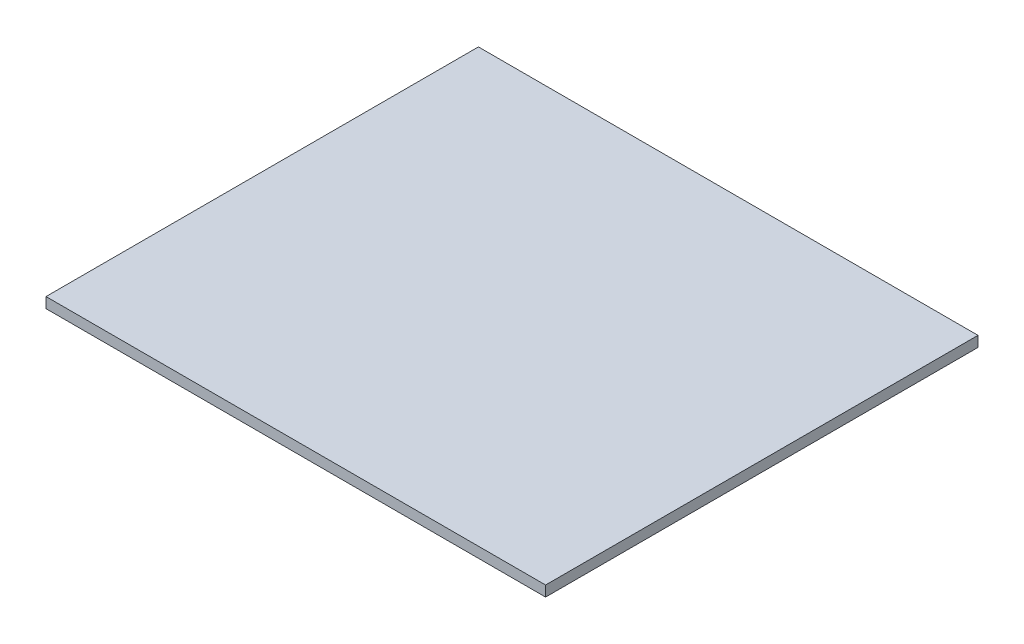
ISO-10303-21;
HEADER;
FILE_DESCRIPTION(('STEP AP214'),'2;1');
FILE_NAME('part.step','',(''),(''),'','','');
FILE_SCHEMA(('AUTOMOTIVE_DESIGN { 1 0 10303 214 1 1 1 1 }'));
ENDSEC;
DATA;
#1=APPLICATION_CONTEXT('core data for automotive mechanical design processes');
#2=APPLICATION_PROTOCOL_DEFINITION('international standard','automotive_design',2000,#1);
#3=PRODUCT_CONTEXT('',#1,'mechanical');
#4=PRODUCT('Part','Part','',(#3));
#5=PRODUCT_RELATED_PRODUCT_CATEGORY('part','',(#4));
#6=PRODUCT_DEFINITION_FORMATION('','',#4);
#7=PRODUCT_DEFINITION_CONTEXT('part definition',#1,'design');
#8=PRODUCT_DEFINITION('design','',#6,#7);
#9=PRODUCT_DEFINITION_SHAPE('','',#8);
#10=(LENGTH_UNIT() NAMED_UNIT(*) SI_UNIT(.MILLI.,.METRE.));
#11=(NAMED_UNIT(*) PLANE_ANGLE_UNIT() SI_UNIT($,.RADIAN.));
#12=(NAMED_UNIT(*) SI_UNIT($,.STERADIAN.) SOLID_ANGLE_UNIT());
#13=UNCERTAINTY_MEASURE_WITH_UNIT(LENGTH_MEASURE(1.E-05),#10,'distance_accuracy_value','');
#14=(GEOMETRIC_REPRESENTATION_CONTEXT(3) GLOBAL_UNCERTAINTY_ASSIGNED_CONTEXT((#13)) GLOBAL_UNIT_ASSIGNED_CONTEXT((#10,
#11,#12)) REPRESENTATION_CONTEXT('',''));
#15=CARTESIAN_POINT('',(0.,0.,0.));
#16=DIRECTION('',(0.,0.,1.));
#17=DIRECTION('',(1.,0.,0.));
#18=AXIS2_PLACEMENT_3D('',#15,#16,#17);
#19=CARTESIAN_POINT('',(59.5,2.5,51.5));
#20=DIRECTION('',(-1.,0.,0.));
#21=DIRECTION('',(0.,0.,1.));
#22=AXIS2_PLACEMENT_3D('',#19,#20,#21);
#23=PLANE('',#22);
#24=DIRECTION('',(0.,0.,-1.));
#25=VECTOR('',#24,1.);
#26=CARTESIAN_POINT('',(59.5,0.,51.5));
#27=LINE('',#26,#25);
#28=CARTESIAN_POINT('',(59.5,0.,51.5));
#29=VERTEX_POINT('',#28);
#30=CARTESIAN_POINT('',(59.5,0.,-51.5));
#31=VERTEX_POINT('',#30);
#32=EDGE_CURVE('E99',#29,#31,#27,.T.);
#33=ORIENTED_EDGE('',*,*,#32,.T.);
#34=DIRECTION('',(0.,-1.,0.));
#35=VECTOR('',#34,1.);
#36=CARTESIAN_POINT('',(59.5,2.5,-51.5));
#37=LINE('',#36,#35);
#38=CARTESIAN_POINT('',(59.5,2.5,-51.5));
#39=VERTEX_POINT('',#38);
#40=EDGE_CURVE('E11',#39,#31,#37,.T.);
#41=ORIENTED_EDGE('',*,*,#40,.F.);
#42=DIRECTION('',(0.,0.,-1.));
#43=VECTOR('',#42,1.);
#44=CARTESIAN_POINT('',(59.5,2.5,51.5));
#45=LINE('',#44,#43);
#46=CARTESIAN_POINT('',(59.5,2.5,51.5));
#47=VERTEX_POINT('',#46);
#48=EDGE_CURVE('E87',#47,#39,#45,.T.);
#49=ORIENTED_EDGE('',*,*,#48,.F.);
#50=DIRECTION('',(0.,-1.,0.));
#51=VECTOR('',#50,1.);
#52=CARTESIAN_POINT('',(59.5,2.5,51.5));
#53=LINE('',#52,#51);
#54=EDGE_CURVE('E95',#47,#29,#53,.T.);
#55=ORIENTED_EDGE('',*,*,#54,.T.);
#56=EDGE_LOOP('',(#33,#41,#49,#55));
#57=FACE_BOUND('',#56,.T.);
#58=ADVANCED_FACE('F36',(#57),#23,.F.);
#59=CARTESIAN_POINT('',(-59.5,2.5,-51.5));
#60=DIRECTION('',(0.,0.,1.));
#61=DIRECTION('',(1.,0.,0.));
#62=AXIS2_PLACEMENT_3D('',#59,#60,#61);
#63=PLANE('',#62);
#64=DIRECTION('',(-1.,0.,0.));
#65=VECTOR('',#64,1.);
#66=CARTESIAN_POINT('',(-59.5,0.,-51.5));
#67=LINE('',#66,#65);
#68=CARTESIAN_POINT('',(-59.5,0.,-51.5));
#69=VERTEX_POINT('',#68);
#70=EDGE_CURVE('E91',#31,#69,#67,.T.);
#71=ORIENTED_EDGE('',*,*,#70,.T.);
#72=DIRECTION('',(0.,-1.,0.));
#73=VECTOR('',#72,1.);
#74=CARTESIAN_POINT('',(-59.5,2.5,-51.5));
#75=LINE('',#74,#73);
#76=CARTESIAN_POINT('',(-59.5,2.5,-51.5));
#77=VERTEX_POINT('',#76);
#78=EDGE_CURVE('E44',#77,#69,#75,.T.);
#79=ORIENTED_EDGE('',*,*,#78,.F.);
#80=DIRECTION('',(-1.,0.,0.));
#81=VECTOR('',#80,1.);
#82=CARTESIAN_POINT('',(-59.5,2.5,-51.5));
#83=LINE('',#82,#81);
#84=EDGE_CURVE('E82',#39,#77,#83,.T.);
#85=ORIENTED_EDGE('',*,*,#84,.F.);
#86=ORIENTED_EDGE('',*,*,#40,.T.);
#87=EDGE_LOOP('',(#71,#79,#85,#86));
#88=FACE_BOUND('',#87,.T.);
#89=ADVANCED_FACE('F90',(#88),#63,.F.);
#90=CARTESIAN_POINT('',(-59.5,2.5,51.5));
#91=DIRECTION('',(1.,0.,0.));
#92=DIRECTION('',(0.,0.,-1.));
#93=AXIS2_PLACEMENT_3D('',#90,#91,#92);
#94=PLANE('',#93);
#95=DIRECTION('',(0.,0.,1.));
#96=VECTOR('',#95,1.);
#97=CARTESIAN_POINT('',(-59.5,0.,51.5));
#98=LINE('',#97,#96);
#99=CARTESIAN_POINT('',(-59.5,0.,51.5));
#100=VERTEX_POINT('',#99);
#101=EDGE_CURVE('E69',#69,#100,#98,.T.);
#102=ORIENTED_EDGE('',*,*,#101,.T.);
#103=DIRECTION('',(0.,-1.,0.));
#104=VECTOR('',#103,1.);
#105=CARTESIAN_POINT('',(-59.5,2.5,51.5));
#106=LINE('',#105,#104);
#107=CARTESIAN_POINT('',(-59.5,2.5,51.5));
#108=VERTEX_POINT('',#107);
#109=EDGE_CURVE('E92',#108,#100,#106,.T.);
#110=ORIENTED_EDGE('',*,*,#109,.F.);
#111=DIRECTION('',(0.,0.,1.));
#112=VECTOR('',#111,1.);
#113=CARTESIAN_POINT('',(-59.5,2.5,51.5));
#114=LINE('',#113,#112);
#115=EDGE_CURVE('E85',#77,#108,#114,.T.);
#116=ORIENTED_EDGE('',*,*,#115,.F.);
#117=ORIENTED_EDGE('',*,*,#78,.T.);
#118=EDGE_LOOP('',(#102,#110,#116,#117));
#119=FACE_BOUND('',#118,.T.);
#120=ADVANCED_FACE('F93',(#119),#94,.F.);
#121=CARTESIAN_POINT('',(-59.5,2.5,51.5));
#122=DIRECTION('',(0.,0.,-1.));
#123=DIRECTION('',(-1.,0.,0.));
#124=AXIS2_PLACEMENT_3D('',#121,#122,#123);
#125=PLANE('',#124);
#126=DIRECTION('',(1.,0.,0.));
#127=VECTOR('',#126,1.);
#128=CARTESIAN_POINT('',(-59.5,0.,51.5));
#129=LINE('',#128,#127);
#130=EDGE_CURVE('E75',#100,#29,#129,.T.);
#131=ORIENTED_EDGE('',*,*,#130,.T.);
#132=ORIENTED_EDGE('',*,*,#54,.F.);
#133=DIRECTION('',(1.,0.,0.));
#134=VECTOR('',#133,1.);
#135=CARTESIAN_POINT('',(-59.5,2.5,51.5));
#136=LINE('',#135,#134);
#137=EDGE_CURVE('E52',#108,#47,#136,.T.);
#138=ORIENTED_EDGE('',*,*,#137,.F.);
#139=ORIENTED_EDGE('',*,*,#109,.T.);
#140=EDGE_LOOP('',(#131,#132,#138,#139));
#141=FACE_BOUND('',#140,.T.);
#142=ADVANCED_FACE('F106',(#141),#125,.F.);
#143=CARTESIAN_POINT('',(0.,2.5,0.));
#144=DIRECTION('',(0.,-1.,0.));
#145=DIRECTION('',(0.,0.,-1.));
#146=AXIS2_PLACEMENT_3D('',#143,#144,#145);
#147=PLANE('',#146);
#148=ORIENTED_EDGE('',*,*,#48,.T.);
#149=ORIENTED_EDGE('',*,*,#84,.T.);
#150=ORIENTED_EDGE('',*,*,#115,.T.);
#151=ORIENTED_EDGE('',*,*,#137,.T.);
#152=EDGE_LOOP('',(#148,#149,#150,#151));
#153=FACE_BOUND('',#152,.T.);
#154=ADVANCED_FACE('F83',(#153),#147,.F.);
#155=CARTESIAN_POINT('',(0.,0.,0.));
#156=DIRECTION('',(0.,-1.,0.));
#157=DIRECTION('',(0.,0.,-1.));
#158=AXIS2_PLACEMENT_3D('',#155,#156,#157);
#159=PLANE('',#158);
#160=ORIENTED_EDGE('',*,*,#32,.F.);
#161=ORIENTED_EDGE('',*,*,#130,.F.);
#162=ORIENTED_EDGE('',*,*,#101,.F.);
#163=ORIENTED_EDGE('',*,*,#70,.F.);
#164=EDGE_LOOP('',(#160,#161,#162,#163));
#165=FACE_BOUND('',#164,.T.);
#166=ADVANCED_FACE('F109',(#165),#159,.T.);
#167=CLOSED_SHELL('',(#58,#89,#120,#142,#154,#166));
#168=MANIFOLD_SOLID_BREP('B2',#167);
#169=ADVANCED_BREP_SHAPE_REPRESENTATION('',(#18,#168),#14);
#170=SHAPE_DEFINITION_REPRESENTATION(#9,#169);
ENDSEC;
END-ISO-10303-21;
